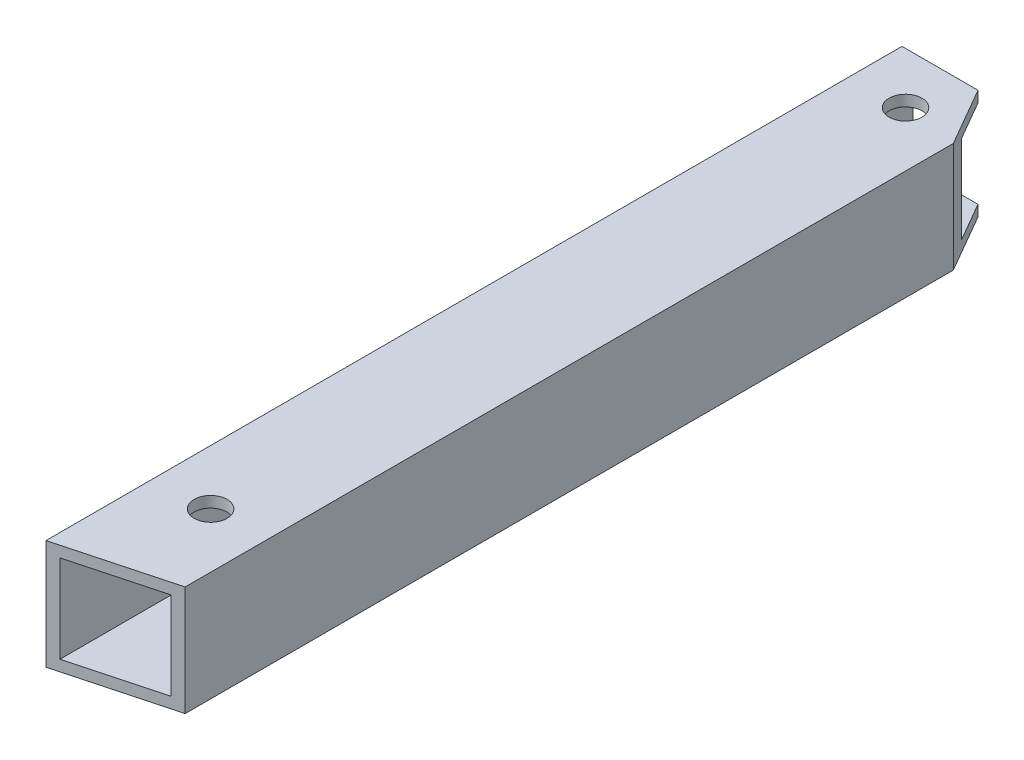
ISO-10303-21;
HEADER;
FILE_DESCRIPTION(('STEP AP214'),'2;1');
FILE_NAME('part.step','',(''),(''),'','','');
FILE_SCHEMA(('AUTOMOTIVE_DESIGN { 1 0 10303 214 1 1 1 1 }'));
ENDSEC;
DATA;
#1=APPLICATION_CONTEXT('core data for automotive mechanical design processes');
#2=APPLICATION_PROTOCOL_DEFINITION('international standard','automotive_design',2000,#1);
#3=PRODUCT_CONTEXT('',#1,'mechanical');
#4=PRODUCT('Part','Part','',(#3));
#5=PRODUCT_RELATED_PRODUCT_CATEGORY('part','',(#4));
#6=PRODUCT_DEFINITION_FORMATION('','',#4);
#7=PRODUCT_DEFINITION_CONTEXT('part definition',#1,'design');
#8=PRODUCT_DEFINITION('design','',#6,#7);
#9=PRODUCT_DEFINITION_SHAPE('','',#8);
#10=(LENGTH_UNIT() NAMED_UNIT(*) SI_UNIT(.MILLI.,.METRE.));
#11=(NAMED_UNIT(*) PLANE_ANGLE_UNIT() SI_UNIT($,.RADIAN.));
#12=(NAMED_UNIT(*) SI_UNIT($,.STERADIAN.) SOLID_ANGLE_UNIT());
#13=UNCERTAINTY_MEASURE_WITH_UNIT(LENGTH_MEASURE(1.E-05),#10,'distance_accuracy_value','');
#14=(GEOMETRIC_REPRESENTATION_CONTEXT(3) GLOBAL_UNCERTAINTY_ASSIGNED_CONTEXT((#13)) GLOBAL_UNIT_ASSIGNED_CONTEXT((#10,
#11,#12)) REPRESENTATION_CONTEXT('',''));
#15=CARTESIAN_POINT('',(0.,0.,0.));
#16=DIRECTION('',(0.,0.,1.));
#17=DIRECTION('',(1.,0.,0.));
#18=AXIS2_PLACEMENT_3D('',#15,#16,#17);
#19=CARTESIAN_POINT('',(-4.99999999999999,4.,90.));
#20=DIRECTION('',(0.,-1.,0.));
#21=DIRECTION('',(0.,0.,-1.));
#22=AXIS2_PLACEMENT_3D('',#19,#20,#21);
#23=PLANE('',#22);
#24=CARTESIAN_POINT('',(0.,4.,16.6765158129173));
#25=DIRECTION('',(0.,-1.,0.));
#26=DIRECTION('',(0.,0.,-1.));
#27=AXIS2_PLACEMENT_3D('',#24,#25,#26);
#28=CIRCLE('',#27,1.49999999999999);
#29=CARTESIAN_POINT('',(0.,4.,15.1765158129173));
#30=VERTEX_POINT('',#29);
#31=EDGE_CURVE('E85',#30,#30,#28,.T.);
#32=ORIENTED_EDGE('',*,*,#31,.F.);
#33=EDGE_LOOP('',(#32));
#34=FACE_BOUND('',#33,.T.);
#35=DIRECTION('',(0.96592582628907,0.,-0.258819045102514));
#36=VECTOR('',#35,1.);
#37=CARTESIAN_POINT('',(-4.99999999999998,4.,90.));
#38=LINE('',#37,#36);
#39=CARTESIAN_POINT('',(-3.99999999999999,4.,89.7320508075689));
#40=VERTEX_POINT('',#39);
#41=CARTESIAN_POINT('',(4.,4.,87.58845726812));
#42=VERTEX_POINT('',#41);
#43=EDGE_CURVE('E12',#40,#42,#38,.T.);
#44=ORIENTED_EDGE('',*,*,#43,.F.);
#45=DIRECTION('',(0.,0.,-1.));
#46=VECTOR('',#45,1.);
#47=CARTESIAN_POINT('',(-3.99999999999999,4.,90.));
#48=LINE('',#47,#46);
#49=CARTESIAN_POINT('',(-3.99999999999999,4.,12.));
#50=VERTEX_POINT('',#49);
#51=EDGE_CURVE('E222',#40,#50,#48,.T.);
#52=ORIENTED_EDGE('',*,*,#51,.T.);
#53=DIRECTION('',(-1.,0.,0.));
#54=VECTOR('',#53,1.);
#55=CARTESIAN_POINT('',(-4.99999999999995,4.,12.));
#56=LINE('',#55,#54);
#57=CARTESIAN_POINT('',(1.92820323027559,4.,12.));
#58=VERTEX_POINT('',#57);
#59=EDGE_CURVE('E190',#58,#50,#56,.T.);
#60=ORIENTED_EDGE('',*,*,#59,.F.);
#61=DIRECTION('',(0.500000000000004,0.,0.866025403784437));
#62=VECTOR('',#61,1.);
#63=CARTESIAN_POINT('',(33.9711431703,4.,67.4999999999997));
#64=LINE('',#63,#62);
#65=CARTESIAN_POINT('',(4.,4.,15.5884572681197));
#66=VERTEX_POINT('',#65);
#67=EDGE_CURVE('E90',#58,#66,#64,.T.);
#68=ORIENTED_EDGE('',*,*,#67,.T.);
#69=DIRECTION('',(0.,0.,-1.));
#70=VECTOR('',#69,1.);
#71=CARTESIAN_POINT('',(4.,4.,90.));
#72=LINE('',#71,#70);
#73=EDGE_CURVE('E225',#42,#66,#72,.T.);
#74=ORIENTED_EDGE('',*,*,#73,.F.);
#75=EDGE_LOOP('',(#44,#52,#60,#68,#74));
#76=FACE_BOUND('',#75,.T.);
#77=CARTESIAN_POINT('',(0.,4.,80.));
#78=DIRECTION('',(0.,-1.,0.));
#79=DIRECTION('',(0.,0.,-1.));
#80=AXIS2_PLACEMENT_3D('',#77,#78,#79);
#81=CIRCLE('',#80,1.5);
#82=CARTESIAN_POINT('',(0.,4.,78.5));
#83=VERTEX_POINT('',#82);
#84=EDGE_CURVE('E194',#83,#83,#81,.T.);
#85=ORIENTED_EDGE('',*,*,#84,.F.);
#86=EDGE_LOOP('',(#85));
#87=FACE_BOUND('',#86,.T.);
#88=ADVANCED_FACE('F81',(#34,#76,#87),#23,.T.);
#89=CARTESIAN_POINT('',(4.,5.,90.));
#90=DIRECTION('',(-1.,0.,0.));
#91=DIRECTION('',(0.,0.,1.));
#92=AXIS2_PLACEMENT_3D('',#89,#90,#91);
#93=PLANE('',#92);
#94=DIRECTION('',(0.,-1.,0.));
#95=VECTOR('',#94,1.);
#96=CARTESIAN_POINT('',(4.,5.,87.58845726812));
#97=LINE('',#96,#95);
#98=CARTESIAN_POINT('',(4.,-3.99999999999999,87.58845726812));
#99=VERTEX_POINT('',#98);
#100=EDGE_CURVE('E201',#42,#99,#97,.T.);
#101=ORIENTED_EDGE('',*,*,#100,.F.);
#102=ORIENTED_EDGE('',*,*,#73,.T.);
#103=DIRECTION('',(0.,-1.,0.));
#104=VECTOR('',#103,1.);
#105=CARTESIAN_POINT('',(4.,5.,15.5884572681197));
#106=LINE('',#105,#104);
#107=CARTESIAN_POINT('',(4.,-3.99999999999999,15.5884572681197));
#108=VERTEX_POINT('',#107);
#109=EDGE_CURVE('E204',#66,#108,#106,.T.);
#110=ORIENTED_EDGE('',*,*,#109,.T.);
#111=DIRECTION('',(0.,0.,-1.));
#112=VECTOR('',#111,1.);
#113=CARTESIAN_POINT('',(4.,-3.99999999999999,90.));
#114=LINE('',#113,#112);
#115=EDGE_CURVE('E181',#99,#108,#114,.T.);
#116=ORIENTED_EDGE('',*,*,#115,.F.);
#117=EDGE_LOOP('',(#101,#102,#110,#116));
#118=FACE_BOUND('',#117,.T.);
#119=ADVANCED_FACE('F234',(#118),#93,.T.);
#120=CARTESIAN_POINT('',(-4.99999999999999,-3.99999999999999,90.));
#121=DIRECTION('',(0.,1.,0.));
#122=DIRECTION('',(0.,0.,1.));
#123=AXIS2_PLACEMENT_3D('',#120,#121,#122);
#124=PLANE('',#123);
#125=CARTESIAN_POINT('',(0.,-3.99999999999999,16.6765158129173));
#126=DIRECTION('',(0.,1.,0.));
#127=DIRECTION('',(0.,0.,1.));
#128=AXIS2_PLACEMENT_3D('',#125,#126,#127);
#129=CIRCLE('',#128,1.49999999999999);
#130=CARTESIAN_POINT('',(0.,-3.99999999999999,18.1765158129173));
#131=VERTEX_POINT('',#130);
#132=EDGE_CURVE('E219',#131,#131,#129,.T.);
#133=ORIENTED_EDGE('',*,*,#132,.F.);
#134=EDGE_LOOP('',(#133));
#135=FACE_BOUND('',#134,.T.);
#136=DIRECTION('',(-0.96592582628907,0.,0.258819045102514));
#137=VECTOR('',#136,1.);
#138=CARTESIAN_POINT('',(-4.99999999999998,-3.99999999999999,90.));
#139=LINE('',#138,#137);
#140=CARTESIAN_POINT('',(-3.99999999999999,-3.99999999999999,89.7320508075689));
#141=VERTEX_POINT('',#140);
#142=EDGE_CURVE('E215',#99,#141,#139,.T.);
#143=ORIENTED_EDGE('',*,*,#142,.F.);
#144=ORIENTED_EDGE('',*,*,#115,.T.);
#145=DIRECTION('',(-0.500000000000004,0.,-0.866025403784437));
#146=VECTOR('',#145,1.);
#147=CARTESIAN_POINT('',(33.9711431703,-3.99999999999999,67.4999999999997));
#148=LINE('',#147,#146);
#149=CARTESIAN_POINT('',(1.92820323027559,-3.99999999999999,12.));
#150=VERTEX_POINT('',#149);
#151=EDGE_CURVE('E197',#108,#150,#148,.T.);
#152=ORIENTED_EDGE('',*,*,#151,.T.);
#153=DIRECTION('',(1.,0.,0.));
#154=VECTOR('',#153,1.);
#155=CARTESIAN_POINT('',(-4.99999999999995,-3.99999999999999,12.));
#156=LINE('',#155,#154);
#157=CARTESIAN_POINT('',(-3.99999999999999,-3.99999999999999,12.));
#158=VERTEX_POINT('',#157);
#159=EDGE_CURVE('E210',#158,#150,#156,.T.);
#160=ORIENTED_EDGE('',*,*,#159,.F.);
#161=DIRECTION('',(0.,0.,-1.));
#162=VECTOR('',#161,1.);
#163=CARTESIAN_POINT('',(-3.99999999999999,-3.99999999999999,90.));
#164=LINE('',#163,#162);
#165=EDGE_CURVE('E178',#141,#158,#164,.T.);
#166=ORIENTED_EDGE('',*,*,#165,.F.);
#167=EDGE_LOOP('',(#143,#144,#152,#160,#166));
#168=FACE_BOUND('',#167,.T.);
#169=CARTESIAN_POINT('',(0.,-3.99999999999999,80.));
#170=DIRECTION('',(0.,1.,0.));
#171=DIRECTION('',(0.,0.,1.));
#172=AXIS2_PLACEMENT_3D('',#169,#170,#171);
#173=CIRCLE('',#172,1.5);
#174=CARTESIAN_POINT('',(0.,-3.99999999999999,81.5));
#175=VERTEX_POINT('',#174);
#176=EDGE_CURVE('E196',#175,#175,#173,.T.);
#177=ORIENTED_EDGE('',*,*,#176,.F.);
#178=EDGE_LOOP('',(#177));
#179=FACE_BOUND('',#178,.T.);
#180=ADVANCED_FACE('F229',(#135,#168,#179),#124,.T.);
#181=CARTESIAN_POINT('',(-3.99999999999999,5.,90.));
#182=DIRECTION('',(1.,0.,0.));
#183=DIRECTION('',(0.,0.,-1.));
#184=AXIS2_PLACEMENT_3D('',#181,#182,#183);
#185=PLANE('',#184);
#186=DIRECTION('',(0.,1.,0.));
#187=VECTOR('',#186,1.);
#188=CARTESIAN_POINT('',(-3.99999999999999,5.,89.7320508075689));
#189=LINE('',#188,#187);
#190=EDGE_CURVE('E217',#141,#40,#189,.T.);
#191=ORIENTED_EDGE('',*,*,#190,.F.);
#192=ORIENTED_EDGE('',*,*,#165,.T.);
#193=DIRECTION('',(0.,-1.,0.));
#194=VECTOR('',#193,1.);
#195=CARTESIAN_POINT('',(-3.99999999999999,5.,12.));
#196=LINE('',#195,#194);
#197=EDGE_CURVE('E247',#50,#158,#196,.T.);
#198=ORIENTED_EDGE('',*,*,#197,.F.);
#199=ORIENTED_EDGE('',*,*,#51,.F.);
#200=EDGE_LOOP('',(#191,#192,#198,#199));
#201=FACE_BOUND('',#200,.T.);
#202=ADVANCED_FACE('F251',(#201),#185,.T.);
#203=CARTESIAN_POINT('',(-3.74999999999997,5.,2.1650635094611));
#204=DIRECTION('',(0.866025403784436,0.,-0.500000000000004));
#205=DIRECTION('',(-0.500000000000004,0.,-0.866025403784436));
#206=AXIS2_PLACEMENT_3D('',#203,#204,#205);
#207=PLANE('',#206);
#208=ORIENTED_EDGE('',*,*,#109,.F.);
#209=ORIENTED_EDGE('',*,*,#67,.F.);
#210=DIRECTION('',(0.,-1.,0.));
#211=VECTOR('',#210,1.);
#212=CARTESIAN_POINT('',(1.92820323027559,5.,12.));
#213=LINE('',#212,#211);
#214=CARTESIAN_POINT('',(1.92820323027559,5.,12.));
#215=VERTEX_POINT('',#214);
#216=EDGE_CURVE('E248',#215,#58,#213,.T.);
#217=ORIENTED_EDGE('',*,*,#216,.F.);
#218=DIRECTION('',(0.500000000000004,0.,0.866025403784436));
#219=VECTOR('',#218,1.);
#220=CARTESIAN_POINT('',(-3.74999999999997,5.,2.1650635094611));
#221=LINE('',#220,#219);
#222=CARTESIAN_POINT('',(5.,5.,17.3205080756886));
#223=VERTEX_POINT('',#222);
#224=EDGE_CURVE('E261',#215,#223,#221,.T.);
#225=ORIENTED_EDGE('',*,*,#224,.T.);
#226=DIRECTION('',(0.,-1.,0.));
#227=VECTOR('',#226,1.);
#228=CARTESIAN_POINT('',(5.,5.,17.3205080756886));
#229=LINE('',#228,#227);
#230=CARTESIAN_POINT('',(5.,-4.99999999999999,17.3205080756886));
#231=VERTEX_POINT('',#230);
#232=EDGE_CURVE('E252',#223,#231,#229,.T.);
#233=ORIENTED_EDGE('',*,*,#232,.T.);
#234=DIRECTION('',(0.500000000000004,0.,0.866025403784436));
#235=VECTOR('',#234,1.);
#236=CARTESIAN_POINT('',(-3.74999999999997,-4.99999999999999,2.1650635094611));
#237=LINE('',#236,#235);
#238=CARTESIAN_POINT('',(1.92820323027559,-4.99999999999999,12.));
#239=VERTEX_POINT('',#238);
#240=EDGE_CURVE('E262',#239,#231,#237,.T.);
#241=ORIENTED_EDGE('',*,*,#240,.F.);
#242=EDGE_CURVE('E257',#150,#239,#213,.T.);
#243=ORIENTED_EDGE('',*,*,#242,.F.);
#244=ORIENTED_EDGE('',*,*,#151,.F.);
#245=EDGE_LOOP('',(#208,#209,#217,#225,#233,#241,#243,#244));
#246=FACE_BOUND('',#245,.T.);
#247=ADVANCED_FACE('F238',(#246),#207,.T.);
#248=CARTESIAN_POINT('',(0.,5.,12.));
#249=DIRECTION('',(0.,0.,1.));
#250=DIRECTION('',(1.,0.,0.));
#251=AXIS2_PLACEMENT_3D('',#248,#249,#250);
#252=PLANE('',#251);
#253=ORIENTED_EDGE('',*,*,#159,.T.);
#254=ORIENTED_EDGE('',*,*,#242,.T.);
#255=DIRECTION('',(-1.,0.,0.));
#256=VECTOR('',#255,1.);
#257=CARTESIAN_POINT('',(0.,-4.99999999999999,12.));
#258=LINE('',#257,#256);
#259=CARTESIAN_POINT('',(-4.99999999999999,-4.99999999999999,12.));
#260=VERTEX_POINT('',#259);
#261=EDGE_CURVE('E259',#239,#260,#258,.T.);
#262=ORIENTED_EDGE('',*,*,#261,.T.);
#263=DIRECTION('',(0.,-1.,0.));
#264=VECTOR('',#263,1.);
#265=CARTESIAN_POINT('',(-4.99999999999999,5.,12.));
#266=LINE('',#265,#264);
#267=CARTESIAN_POINT('',(-4.99999999999999,5.,12.));
#268=VERTEX_POINT('',#267);
#269=EDGE_CURVE('E105',#268,#260,#266,.T.);
#270=ORIENTED_EDGE('',*,*,#269,.F.);
#271=DIRECTION('',(-1.,0.,0.));
#272=VECTOR('',#271,1.);
#273=CARTESIAN_POINT('',(0.,5.,12.));
#274=LINE('',#273,#272);
#275=EDGE_CURVE('E171',#215,#268,#274,.T.);
#276=ORIENTED_EDGE('',*,*,#275,.F.);
#277=ORIENTED_EDGE('',*,*,#216,.T.);
#278=ORIENTED_EDGE('',*,*,#59,.T.);
#279=ORIENTED_EDGE('',*,*,#197,.T.);
#280=EDGE_LOOP('',(#253,#254,#262,#270,#276,#277,#278,#279));
#281=FACE_BOUND('',#280,.T.);
#282=ADVANCED_FACE('F246',(#281),#252,.F.);
#283=CARTESIAN_POINT('',(0.,5.,80.));
#284=DIRECTION('',(0.,-1.,0.));
#285=DIRECTION('',(0.,0.,-1.));
#286=AXIS2_PLACEMENT_3D('',#283,#284,#285);
#287=CYLINDRICAL_SURFACE('',#286,1.5);
#288=ORIENTED_EDGE('',*,*,#84,.T.);
#289=EDGE_LOOP('',(#288));
#290=FACE_BOUND('',#289,.T.);
#291=CARTESIAN_POINT('',(0.,5.,80.));
#292=DIRECTION('',(0.,-1.,0.));
#293=DIRECTION('',(0.,0.,-1.));
#294=AXIS2_PLACEMENT_3D('',#291,#292,#293);
#295=CIRCLE('',#294,1.5);
#296=CARTESIAN_POINT('',(0.,5.,78.5));
#297=VERTEX_POINT('',#296);
#298=EDGE_CURVE('E270',#297,#297,#295,.T.);
#299=ORIENTED_EDGE('',*,*,#298,.F.);
#300=EDGE_LOOP('',(#299));
#301=FACE_BOUND('',#300,.T.);
#302=ADVANCED_FACE('F283',(#290,#301),#287,.F.);
#303=CARTESIAN_POINT('',(22.1650635094606,5.,82.7211431703001));
#304=DIRECTION('',(-0.258819045102514,0.,-0.96592582628907));
#305=DIRECTION('',(-0.96592582628907,0.,0.258819045102514));
#306=AXIS2_PLACEMENT_3D('',#303,#304,#305);
#307=PLANE('',#306);
#308=ORIENTED_EDGE('',*,*,#190,.T.);
#309=ORIENTED_EDGE('',*,*,#43,.T.);
#310=ORIENTED_EDGE('',*,*,#100,.T.);
#311=ORIENTED_EDGE('',*,*,#142,.T.);
#312=EDGE_LOOP('',(#308,#309,#310,#311));
#313=FACE_BOUND('',#312,.T.);
#314=DIRECTION('',(0.96592582628907,0.,-0.258819045102514));
#315=VECTOR('',#314,1.);
#316=CARTESIAN_POINT('',(22.1650635094606,-4.99999999999999,82.7211431703001));
#317=LINE('',#316,#315);
#318=CARTESIAN_POINT('',(-4.99999999999999,-4.99999999999999,90.));
#319=VERTEX_POINT('',#318);
#320=CARTESIAN_POINT('',(5.00000000000001,-4.99999999999999,87.3205080756889));
#321=VERTEX_POINT('',#320);
#322=EDGE_CURVE('E165',#319,#321,#317,.T.);
#323=ORIENTED_EDGE('',*,*,#322,.T.);
#324=DIRECTION('',(0.,-1.,0.));
#325=VECTOR('',#324,1.);
#326=CARTESIAN_POINT('',(5.00000000000001,5.,87.3205080756889));
#327=LINE('',#326,#325);
#328=CARTESIAN_POINT('',(5.,5.,87.3205080756889));
#329=VERTEX_POINT('',#328);
#330=EDGE_CURVE('E97',#329,#321,#327,.T.);
#331=ORIENTED_EDGE('',*,*,#330,.F.);
#332=DIRECTION('',(0.96592582628907,0.,-0.258819045102514));
#333=VECTOR('',#332,1.);
#334=CARTESIAN_POINT('',(22.1650635094606,5.,82.7211431703001));
#335=LINE('',#334,#333);
#336=CARTESIAN_POINT('',(-4.99999999999999,5.,90.));
#337=VERTEX_POINT('',#336);
#338=EDGE_CURVE('E156',#337,#329,#335,.T.);
#339=ORIENTED_EDGE('',*,*,#338,.F.);
#340=DIRECTION('',(0.,-1.,0.));
#341=VECTOR('',#340,1.);
#342=CARTESIAN_POINT('',(-4.99999999999999,5.,90.));
#343=LINE('',#342,#341);
#344=EDGE_CURVE('E160',#337,#319,#343,.T.);
#345=ORIENTED_EDGE('',*,*,#344,.T.);
#346=EDGE_LOOP('',(#323,#331,#339,#345));
#347=FACE_BOUND('',#346,.T.);
#348=ADVANCED_FACE('F158',(#313,#347),#307,.F.);
#349=CARTESIAN_POINT('',(0.,5.,16.6765158129173));
#350=DIRECTION('',(0.,-1.,0.));
#351=DIRECTION('',(0.,0.,-1.));
#352=AXIS2_PLACEMENT_3D('',#349,#350,#351);
#353=CYLINDRICAL_SURFACE('',#352,1.49999999999999);
#354=ORIENTED_EDGE('',*,*,#31,.T.);
#355=EDGE_LOOP('',(#354));
#356=FACE_BOUND('',#355,.T.);
#357=CARTESIAN_POINT('',(0.,5.,16.6765158129173));
#358=DIRECTION('',(0.,-1.,0.));
#359=DIRECTION('',(0.,0.,-1.));
#360=AXIS2_PLACEMENT_3D('',#357,#358,#359);
#361=CIRCLE('',#360,1.49999999999999);
#362=CARTESIAN_POINT('',(0.,5.,15.1765158129173));
#363=VERTEX_POINT('',#362);
#364=EDGE_CURVE('E265',#363,#363,#361,.T.);
#365=ORIENTED_EDGE('',*,*,#364,.F.);
#366=EDGE_LOOP('',(#365));
#367=FACE_BOUND('',#366,.T.);
#368=ADVANCED_FACE('F291',(#356,#367),#353,.F.);
#369=ORIENTED_EDGE('',*,*,#176,.T.);
#370=EDGE_LOOP('',(#369));
#371=FACE_BOUND('',#370,.T.);
#372=CARTESIAN_POINT('',(0.,-4.99999999999999,80.));
#373=DIRECTION('',(0.,-1.,0.));
#374=DIRECTION('',(0.,0.,-1.));
#375=AXIS2_PLACEMENT_3D('',#372,#373,#374);
#376=CIRCLE('',#375,1.5);
#377=CARTESIAN_POINT('',(0.,-4.99999999999999,78.5));
#378=VERTEX_POINT('',#377);
#379=EDGE_CURVE('E276',#378,#378,#376,.T.);
#380=ORIENTED_EDGE('',*,*,#379,.T.);
#381=EDGE_LOOP('',(#380));
#382=FACE_BOUND('',#381,.T.);
#383=ADVANCED_FACE('F286',(#371,#382),#287,.F.);
#384=ORIENTED_EDGE('',*,*,#132,.T.);
#385=EDGE_LOOP('',(#384));
#386=FACE_BOUND('',#385,.T.);
#387=CARTESIAN_POINT('',(0.,-4.99999999999999,16.6765158129173));
#388=DIRECTION('',(0.,-1.,0.));
#389=DIRECTION('',(0.,0.,-1.));
#390=AXIS2_PLACEMENT_3D('',#387,#388,#389);
#391=CIRCLE('',#390,1.49999999999999);
#392=CARTESIAN_POINT('',(0.,-4.99999999999999,15.1765158129173));
#393=VERTEX_POINT('',#392);
#394=EDGE_CURVE('E269',#393,#393,#391,.T.);
#395=ORIENTED_EDGE('',*,*,#394,.T.);
#396=EDGE_LOOP('',(#395));
#397=FACE_BOUND('',#396,.T.);
#398=ADVANCED_FACE('F297',(#386,#397),#353,.F.);
#399=CARTESIAN_POINT('',(-4.99999999999999,-4.99999999999999,90.));
#400=DIRECTION('',(0.,1.,0.));
#401=DIRECTION('',(0.,0.,1.));
#402=AXIS2_PLACEMENT_3D('',#399,#400,#401);
#403=PLANE('',#402);
#404=ORIENTED_EDGE('',*,*,#394,.F.);
#405=EDGE_LOOP('',(#404));
#406=FACE_BOUND('',#405,.T.);
#407=ORIENTED_EDGE('',*,*,#379,.F.);
#408=EDGE_LOOP('',(#407));
#409=FACE_BOUND('',#408,.T.);
#410=DIRECTION('',(0.,0.,-1.));
#411=VECTOR('',#410,1.);
#412=CARTESIAN_POINT('',(5.,-4.99999999999999,90.));
#413=LINE('',#412,#411);
#414=EDGE_CURVE('E186',#321,#231,#413,.T.);
#415=ORIENTED_EDGE('',*,*,#414,.F.);
#416=ORIENTED_EDGE('',*,*,#322,.F.);
#417=DIRECTION('',(0.,0.,-1.));
#418=VECTOR('',#417,1.);
#419=CARTESIAN_POINT('',(-4.99999999999999,-4.99999999999999,90.));
#420=LINE('',#419,#418);
#421=EDGE_CURVE('E177',#319,#260,#420,.T.);
#422=ORIENTED_EDGE('',*,*,#421,.T.);
#423=ORIENTED_EDGE('',*,*,#261,.F.);
#424=ORIENTED_EDGE('',*,*,#240,.T.);
#425=EDGE_LOOP('',(#415,#416,#422,#423,#424));
#426=FACE_BOUND('',#425,.T.);
#427=ADVANCED_FACE('F319',(#406,#409,#426),#403,.F.);
#428=CARTESIAN_POINT('',(5.,5.,90.));
#429=DIRECTION('',(-1.,0.,0.));
#430=DIRECTION('',(0.,0.,1.));
#431=AXIS2_PLACEMENT_3D('',#428,#429,#430);
#432=PLANE('',#431);
#433=DIRECTION('',(0.,0.,-1.));
#434=VECTOR('',#433,1.);
#435=CARTESIAN_POINT('',(5.,5.,90.));
#436=LINE('',#435,#434);
#437=EDGE_CURVE('E173',#329,#223,#436,.T.);
#438=ORIENTED_EDGE('',*,*,#437,.F.);
#439=ORIENTED_EDGE('',*,*,#330,.T.);
#440=ORIENTED_EDGE('',*,*,#414,.T.);
#441=ORIENTED_EDGE('',*,*,#232,.F.);
#442=EDGE_LOOP('',(#438,#439,#440,#441));
#443=FACE_BOUND('',#442,.T.);
#444=ADVANCED_FACE('F316',(#443),#432,.F.);
#445=CARTESIAN_POINT('',(-4.99999999999999,5.,90.));
#446=DIRECTION('',(0.,-1.,0.));
#447=DIRECTION('',(0.,0.,-1.));
#448=AXIS2_PLACEMENT_3D('',#445,#446,#447);
#449=PLANE('',#448);
#450=ORIENTED_EDGE('',*,*,#364,.T.);
#451=EDGE_LOOP('',(#450));
#452=FACE_BOUND('',#451,.T.);
#453=ORIENTED_EDGE('',*,*,#298,.T.);
#454=EDGE_LOOP('',(#453));
#455=FACE_BOUND('',#454,.T.);
#456=DIRECTION('',(0.,0.,-1.));
#457=VECTOR('',#456,1.);
#458=CARTESIAN_POINT('',(-4.99999999999999,5.,90.));
#459=LINE('',#458,#457);
#460=EDGE_CURVE('E168',#337,#268,#459,.T.);
#461=ORIENTED_EDGE('',*,*,#460,.F.);
#462=ORIENTED_EDGE('',*,*,#338,.T.);
#463=ORIENTED_EDGE('',*,*,#437,.T.);
#464=ORIENTED_EDGE('',*,*,#224,.F.);
#465=ORIENTED_EDGE('',*,*,#275,.T.);
#466=EDGE_LOOP('',(#461,#462,#463,#464,#465));
#467=FACE_BOUND('',#466,.T.);
#468=ADVANCED_FACE('F169',(#452,#455,#467),#449,.F.);
#469=CARTESIAN_POINT('',(-4.99999999999999,5.,90.));
#470=DIRECTION('',(1.,0.,0.));
#471=DIRECTION('',(0.,0.,-1.));
#472=AXIS2_PLACEMENT_3D('',#469,#470,#471);
#473=PLANE('',#472);
#474=ORIENTED_EDGE('',*,*,#460,.T.);
#475=ORIENTED_EDGE('',*,*,#269,.T.);
#476=ORIENTED_EDGE('',*,*,#421,.F.);
#477=ORIENTED_EDGE('',*,*,#344,.F.);
#478=EDGE_LOOP('',(#474,#475,#476,#477));
#479=FACE_BOUND('',#478,.T.);
#480=ADVANCED_FACE('F83',(#479),#473,.F.);
#481=CLOSED_SHELL('',(#88,#119,#180,#202,#247,#282,#302,#348,#368,#383,#398,#427,#444,#468,#480));
#482=MANIFOLD_SOLID_BREP('B2',#481);
#483=ADVANCED_BREP_SHAPE_REPRESENTATION('',(#18,#482),#14);
#484=SHAPE_DEFINITION_REPRESENTATION(#9,#483);
ENDSEC;
END-ISO-10303-21;
